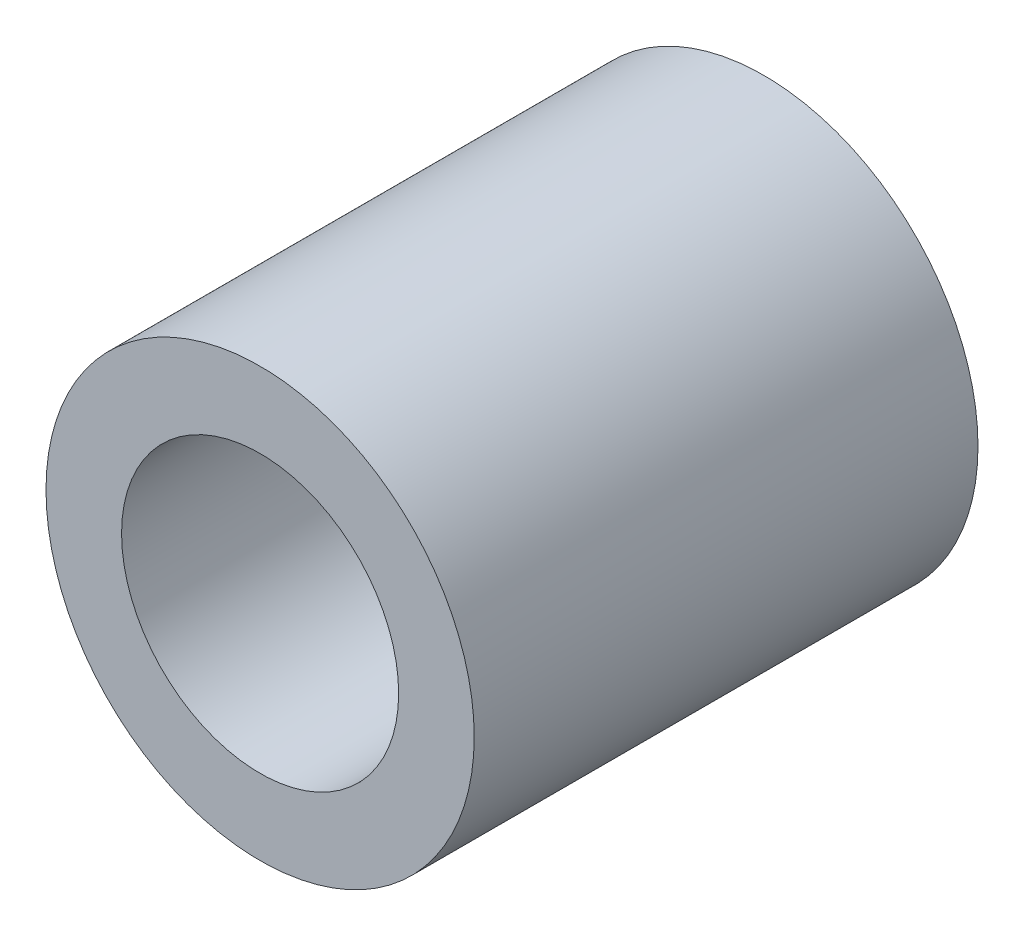
ISO-10303-21;
HEADER;
FILE_DESCRIPTION(('STEP AP214'),'2;1');
FILE_NAME('part.step','',(''),(''),'','','');
FILE_SCHEMA(('AUTOMOTIVE_DESIGN { 1 0 10303 214 1 1 1 1 }'));
ENDSEC;
DATA;
#1=APPLICATION_CONTEXT('core data for automotive mechanical design processes');
#2=APPLICATION_PROTOCOL_DEFINITION('international standard','automotive_design',2000,#1);
#3=PRODUCT_CONTEXT('',#1,'mechanical');
#4=PRODUCT('Part','Part','',(#3));
#5=PRODUCT_RELATED_PRODUCT_CATEGORY('part','',(#4));
#6=PRODUCT_DEFINITION_FORMATION('','',#4);
#7=PRODUCT_DEFINITION_CONTEXT('part definition',#1,'design');
#8=PRODUCT_DEFINITION('design','',#6,#7);
#9=PRODUCT_DEFINITION_SHAPE('','',#8);
#10=(LENGTH_UNIT() NAMED_UNIT(*) SI_UNIT(.MILLI.,.METRE.));
#11=(NAMED_UNIT(*) PLANE_ANGLE_UNIT() SI_UNIT($,.RADIAN.));
#12=(NAMED_UNIT(*) SI_UNIT($,.STERADIAN.) SOLID_ANGLE_UNIT());
#13=UNCERTAINTY_MEASURE_WITH_UNIT(LENGTH_MEASURE(1.E-05),#10,'distance_accuracy_value','');
#14=(GEOMETRIC_REPRESENTATION_CONTEXT(3) GLOBAL_UNCERTAINTY_ASSIGNED_CONTEXT((#13)) GLOBAL_UNIT_ASSIGNED_CONTEXT((#10,
#11,#12)) REPRESENTATION_CONTEXT('',''));
#15=CARTESIAN_POINT('',(0.,0.,0.));
#16=DIRECTION('',(0.,0.,1.));
#17=DIRECTION('',(1.,0.,0.));
#18=AXIS2_PLACEMENT_3D('',#15,#16,#17);
#19=CARTESIAN_POINT('',(0.,0.,10.));
#20=DIRECTION('',(0.,0.,1.));
#21=DIRECTION('',(1.,0.,0.));
#22=AXIS2_PLACEMENT_3D('',#19,#20,#21);
#23=PLANE('',#22);
#24=CARTESIAN_POINT('',(0.,0.,10.));
#25=DIRECTION('',(0.,0.,1.));
#26=DIRECTION('',(1.,0.,0.));
#27=AXIS2_PLACEMENT_3D('',#24,#25,#26);
#28=CIRCLE('',#27,4.25);
#29=CARTESIAN_POINT('',(4.25,0.,10.));
#30=VERTEX_POINT('',#29);
#31=EDGE_CURVE('E10',#30,#30,#28,.T.);
#32=ORIENTED_EDGE('',*,*,#31,.T.);
#33=EDGE_LOOP('',(#32));
#34=FACE_BOUND('',#33,.T.);
#35=CARTESIAN_POINT('',(0.,0.,10.));
#36=DIRECTION('',(0.,0.,1.));
#37=DIRECTION('',(1.,0.,0.));
#38=AXIS2_PLACEMENT_3D('',#35,#36,#37);
#39=CIRCLE('',#38,2.75);
#40=CARTESIAN_POINT('',(2.75,0.,10.));
#41=VERTEX_POINT('',#40);
#42=EDGE_CURVE('E44',#41,#41,#39,.T.);
#43=ORIENTED_EDGE('',*,*,#42,.F.);
#44=EDGE_LOOP('',(#43));
#45=FACE_BOUND('',#44,.T.);
#46=ADVANCED_FACE('F33',(#34,#45),#23,.T.);
#47=CARTESIAN_POINT('',(0.,0.,0.));
#48=DIRECTION('',(0.,0.,1.));
#49=DIRECTION('',(1.,0.,0.));
#50=AXIS2_PLACEMENT_3D('',#47,#48,#49);
#51=PLANE('',#50);
#52=CARTESIAN_POINT('',(0.,0.,0.));
#53=DIRECTION('',(0.,0.,1.));
#54=DIRECTION('',(1.,0.,0.));
#55=AXIS2_PLACEMENT_3D('',#52,#53,#54);
#56=CIRCLE('',#55,4.25);
#57=CARTESIAN_POINT('',(4.25,0.,0.));
#58=VERTEX_POINT('',#57);
#59=EDGE_CURVE('E37',#58,#58,#56,.T.);
#60=ORIENTED_EDGE('',*,*,#59,.F.);
#61=EDGE_LOOP('',(#60));
#62=FACE_BOUND('',#61,.T.);
#63=CARTESIAN_POINT('',(0.,0.,0.));
#64=DIRECTION('',(0.,0.,1.));
#65=DIRECTION('',(1.,0.,0.));
#66=AXIS2_PLACEMENT_3D('',#63,#64,#65);
#67=CIRCLE('',#66,2.75);
#68=CARTESIAN_POINT('',(2.75,0.,0.));
#69=VERTEX_POINT('',#68);
#70=EDGE_CURVE('E46',#69,#69,#67,.T.);
#71=ORIENTED_EDGE('',*,*,#70,.T.);
#72=EDGE_LOOP('',(#71));
#73=FACE_BOUND('',#72,.T.);
#74=ADVANCED_FACE('F56',(#62,#73),#51,.F.);
#75=CARTESIAN_POINT('',(0.,0.,10.));
#76=DIRECTION('',(0.,0.,-1.));
#77=DIRECTION('',(-1.,0.,0.));
#78=AXIS2_PLACEMENT_3D('',#75,#76,#77);
#79=CYLINDRICAL_SURFACE('',#78,4.25);
#80=ORIENTED_EDGE('',*,*,#31,.F.);
#81=EDGE_LOOP('',(#80));
#82=FACE_BOUND('',#81,.T.);
#83=ORIENTED_EDGE('',*,*,#59,.T.);
#84=EDGE_LOOP('',(#83));
#85=FACE_BOUND('',#84,.T.);
#86=ADVANCED_FACE('F35',(#82,#85),#79,.T.);
#87=CARTESIAN_POINT('',(0.,0.,10.));
#88=DIRECTION('',(0.,0.,-1.));
#89=DIRECTION('',(-1.,0.,0.));
#90=AXIS2_PLACEMENT_3D('',#87,#88,#89);
#91=CYLINDRICAL_SURFACE('',#90,2.75);
#92=ORIENTED_EDGE('',*,*,#42,.T.);
#93=EDGE_LOOP('',(#92));
#94=FACE_BOUND('',#93,.T.);
#95=ORIENTED_EDGE('',*,*,#70,.F.);
#96=EDGE_LOOP('',(#95));
#97=FACE_BOUND('',#96,.T.);
#98=ADVANCED_FACE('F52',(#94,#97),#91,.F.);
#99=CLOSED_SHELL('',(#46,#74,#86,#98));
#100=MANIFOLD_SOLID_BREP('B2',#99);
#101=ADVANCED_BREP_SHAPE_REPRESENTATION('',(#18,#100),#14);
#102=SHAPE_DEFINITION_REPRESENTATION(#9,#101);
ENDSEC;
END-ISO-10303-21;
